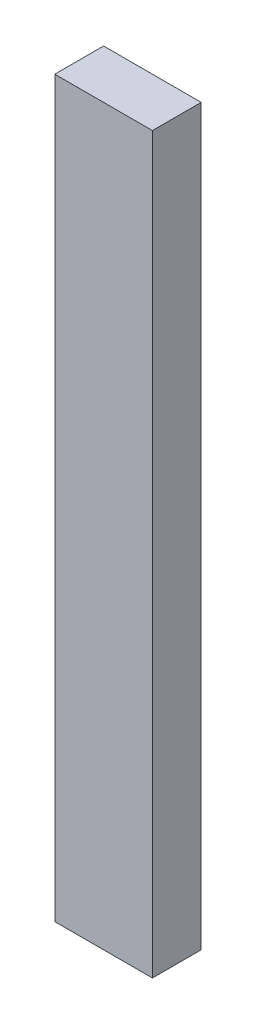
ISO-10303-21;
HEADER;
FILE_DESCRIPTION(('STEP AP214'),'2;1');
FILE_NAME('part.step','',(''),(''),'','','');
FILE_SCHEMA(('AUTOMOTIVE_DESIGN { 1 0 10303 214 1 1 1 1 }'));
ENDSEC;
DATA;
#1=APPLICATION_CONTEXT('core data for automotive mechanical design processes');
#2=APPLICATION_PROTOCOL_DEFINITION('international standard','automotive_design',2000,#1);
#3=PRODUCT_CONTEXT('',#1,'mechanical');
#4=PRODUCT('Part','Part','',(#3));
#5=PRODUCT_RELATED_PRODUCT_CATEGORY('part','',(#4));
#6=PRODUCT_DEFINITION_FORMATION('','',#4);
#7=PRODUCT_DEFINITION_CONTEXT('part definition',#1,'design');
#8=PRODUCT_DEFINITION('design','',#6,#7);
#9=PRODUCT_DEFINITION_SHAPE('','',#8);
#10=(LENGTH_UNIT() NAMED_UNIT(*) SI_UNIT(.MILLI.,.METRE.));
#11=(NAMED_UNIT(*) PLANE_ANGLE_UNIT() SI_UNIT($,.RADIAN.));
#12=(NAMED_UNIT(*) SI_UNIT($,.STERADIAN.) SOLID_ANGLE_UNIT());
#13=UNCERTAINTY_MEASURE_WITH_UNIT(LENGTH_MEASURE(1.E-05),#10,'distance_accuracy_value','');
#14=(GEOMETRIC_REPRESENTATION_CONTEXT(3) GLOBAL_UNCERTAINTY_ASSIGNED_CONTEXT((#13)) GLOBAL_UNIT_ASSIGNED_CONTEXT((#10,
#11,#12)) REPRESENTATION_CONTEXT('',''));
#15=CARTESIAN_POINT('',(0.,0.,0.));
#16=DIRECTION('',(0.,0.,1.));
#17=DIRECTION('',(1.,0.,0.));
#18=AXIS2_PLACEMENT_3D('',#15,#16,#17);
#19=CARTESIAN_POINT('',(0.,0.,25.4));
#20=DIRECTION('',(1.,0.,0.));
#21=DIRECTION('',(0.,0.,-1.));
#22=AXIS2_PLACEMENT_3D('',#19,#20,#21);
#23=PLANE('',#22);
#24=DIRECTION('',(0.,-1.,0.));
#25=VECTOR('',#24,1.);
#26=CARTESIAN_POINT('',(0.,0.,-25.4));
#27=LINE('',#26,#25);
#28=CARTESIAN_POINT('',(0.,763.794,-25.4));
#29=VERTEX_POINT('',#28);
#30=CARTESIAN_POINT('',(0.,0.,-25.4));
#31=VERTEX_POINT('',#30);
#32=EDGE_CURVE('E111',#29,#31,#27,.T.);
#33=ORIENTED_EDGE('',*,*,#32,.T.);
#34=DIRECTION('',(0.,0.,-1.));
#35=VECTOR('',#34,1.);
#36=CARTESIAN_POINT('',(0.,0.,25.4));
#37=LINE('',#36,#35);
#38=CARTESIAN_POINT('',(0.,0.,25.4));
#39=VERTEX_POINT('',#38);
#40=EDGE_CURVE('E11',#39,#31,#37,.T.);
#41=ORIENTED_EDGE('',*,*,#40,.F.);
#42=DIRECTION('',(0.,-1.,0.));
#43=VECTOR('',#42,1.);
#44=CARTESIAN_POINT('',(0.,0.,25.4));
#45=LINE('',#44,#43);
#46=CARTESIAN_POINT('',(0.,763.794,25.4));
#47=VERTEX_POINT('',#46);
#48=EDGE_CURVE('E95',#47,#39,#45,.T.);
#49=ORIENTED_EDGE('',*,*,#48,.F.);
#50=DIRECTION('',(0.,0.,-1.));
#51=VECTOR('',#50,1.);
#52=CARTESIAN_POINT('',(0.,763.794,25.4));
#53=LINE('',#52,#51);
#54=EDGE_CURVE('E107',#47,#29,#53,.T.);
#55=ORIENTED_EDGE('',*,*,#54,.T.);
#56=EDGE_LOOP('',(#33,#41,#49,#55));
#57=FACE_BOUND('',#56,.T.);
#58=ADVANCED_FACE('F43',(#57),#23,.F.);
#59=CARTESIAN_POINT('',(0.,0.,25.4));
#60=DIRECTION('',(0.,1.,0.));
#61=DIRECTION('',(0.,0.,1.));
#62=AXIS2_PLACEMENT_3D('',#59,#60,#61);
#63=PLANE('',#62);
#64=DIRECTION('',(1.,0.,0.));
#65=VECTOR('',#64,1.);
#66=CARTESIAN_POINT('',(0.,0.,-25.4));
#67=LINE('',#66,#65);
#68=CARTESIAN_POINT('',(101.6,0.,-25.4));
#69=VERTEX_POINT('',#68);
#70=EDGE_CURVE('E100',#31,#69,#67,.T.);
#71=ORIENTED_EDGE('',*,*,#70,.T.);
#72=DIRECTION('',(0.,0.,-1.));
#73=VECTOR('',#72,1.);
#74=CARTESIAN_POINT('',(101.6,0.,25.4));
#75=LINE('',#74,#73);
#76=CARTESIAN_POINT('',(101.6,0.,25.4));
#77=VERTEX_POINT('',#76);
#78=EDGE_CURVE('E52',#77,#69,#75,.T.);
#79=ORIENTED_EDGE('',*,*,#78,.F.);
#80=DIRECTION('',(1.,0.,0.));
#81=VECTOR('',#80,1.);
#82=CARTESIAN_POINT('',(0.,0.,25.4));
#83=LINE('',#82,#81);
#84=EDGE_CURVE('E90',#39,#77,#83,.T.);
#85=ORIENTED_EDGE('',*,*,#84,.F.);
#86=ORIENTED_EDGE('',*,*,#40,.T.);
#87=EDGE_LOOP('',(#71,#79,#85,#86));
#88=FACE_BOUND('',#87,.T.);
#89=ADVANCED_FACE('F99',(#88),#63,.F.);
#90=CARTESIAN_POINT('',(101.6,0.,25.4));
#91=DIRECTION('',(-1.,0.,0.));
#92=DIRECTION('',(0.,-1.,0.));
#93=AXIS2_PLACEMENT_3D('',#90,#91,#92);
#94=PLANE('',#93);
#95=DIRECTION('',(0.,1.,0.));
#96=VECTOR('',#95,1.);
#97=CARTESIAN_POINT('',(101.6,0.,-25.4));
#98=LINE('',#97,#96);
#99=CARTESIAN_POINT('',(101.6,763.794,-25.4));
#100=VERTEX_POINT('',#99);
#101=EDGE_CURVE('E77',#69,#100,#98,.T.);
#102=ORIENTED_EDGE('',*,*,#101,.T.);
#103=DIRECTION('',(0.,0.,-1.));
#104=VECTOR('',#103,1.);
#105=CARTESIAN_POINT('',(101.6,763.794,25.4));
#106=LINE('',#105,#104);
#107=CARTESIAN_POINT('',(101.6,763.794,25.4));
#108=VERTEX_POINT('',#107);
#109=EDGE_CURVE('E102',#108,#100,#106,.T.);
#110=ORIENTED_EDGE('',*,*,#109,.F.);
#111=DIRECTION('',(0.,1.,0.));
#112=VECTOR('',#111,1.);
#113=CARTESIAN_POINT('',(101.6,0.,25.4));
#114=LINE('',#113,#112);
#115=EDGE_CURVE('E93',#77,#108,#114,.T.);
#116=ORIENTED_EDGE('',*,*,#115,.F.);
#117=ORIENTED_EDGE('',*,*,#78,.T.);
#118=EDGE_LOOP('',(#102,#110,#116,#117));
#119=FACE_BOUND('',#118,.T.);
#120=ADVANCED_FACE('F103',(#119),#94,.F.);
#121=CARTESIAN_POINT('',(0.,763.794,25.4));
#122=DIRECTION('',(0.,-1.,0.));
#123=DIRECTION('',(0.,0.,-1.));
#124=AXIS2_PLACEMENT_3D('',#121,#122,#123);
#125=PLANE('',#124);
#126=DIRECTION('',(-1.,0.,0.));
#127=VECTOR('',#126,1.);
#128=CARTESIAN_POINT('',(0.,763.794,-25.4));
#129=LINE('',#128,#127);
#130=EDGE_CURVE('E83',#100,#29,#129,.T.);
#131=ORIENTED_EDGE('',*,*,#130,.T.);
#132=ORIENTED_EDGE('',*,*,#54,.F.);
#133=DIRECTION('',(-1.,0.,0.));
#134=VECTOR('',#133,1.);
#135=CARTESIAN_POINT('',(0.,763.794,25.4));
#136=LINE('',#135,#134);
#137=EDGE_CURVE('E60',#108,#47,#136,.T.);
#138=ORIENTED_EDGE('',*,*,#137,.F.);
#139=ORIENTED_EDGE('',*,*,#109,.T.);
#140=EDGE_LOOP('',(#131,#132,#138,#139));
#141=FACE_BOUND('',#140,.T.);
#142=ADVANCED_FACE('F124',(#141),#125,.F.);
#143=CARTESIAN_POINT('',(0.,0.,25.4));
#144=DIRECTION('',(0.,0.,-1.));
#145=DIRECTION('',(-1.,0.,0.));
#146=AXIS2_PLACEMENT_3D('',#143,#144,#145);
#147=PLANE('',#146);
#148=ORIENTED_EDGE('',*,*,#48,.T.);
#149=ORIENTED_EDGE('',*,*,#84,.T.);
#150=ORIENTED_EDGE('',*,*,#115,.T.);
#151=ORIENTED_EDGE('',*,*,#137,.T.);
#152=EDGE_LOOP('',(#148,#149,#150,#151));
#153=FACE_BOUND('',#152,.T.);
#154=ADVANCED_FACE('F91',(#153),#147,.F.);
#155=CARTESIAN_POINT('',(0.,0.,-25.4));
#156=DIRECTION('',(0.,0.,-1.));
#157=DIRECTION('',(-1.,0.,0.));
#158=AXIS2_PLACEMENT_3D('',#155,#156,#157);
#159=PLANE('',#158);
#160=ORIENTED_EDGE('',*,*,#32,.F.);
#161=ORIENTED_EDGE('',*,*,#130,.F.);
#162=ORIENTED_EDGE('',*,*,#101,.F.);
#163=ORIENTED_EDGE('',*,*,#70,.F.);
#164=EDGE_LOOP('',(#160,#161,#162,#163));
#165=FACE_BOUND('',#164,.T.);
#166=ADVANCED_FACE('F127',(#165),#159,.T.);
#167=CLOSED_SHELL('',(#58,#89,#120,#142,#154,#166));
#168=MANIFOLD_SOLID_BREP('B2',#167);
#169=ADVANCED_BREP_SHAPE_REPRESENTATION('',(#18,#168),#14);
#170=SHAPE_DEFINITION_REPRESENTATION(#9,#169);
ENDSEC;
END-ISO-10303-21;
